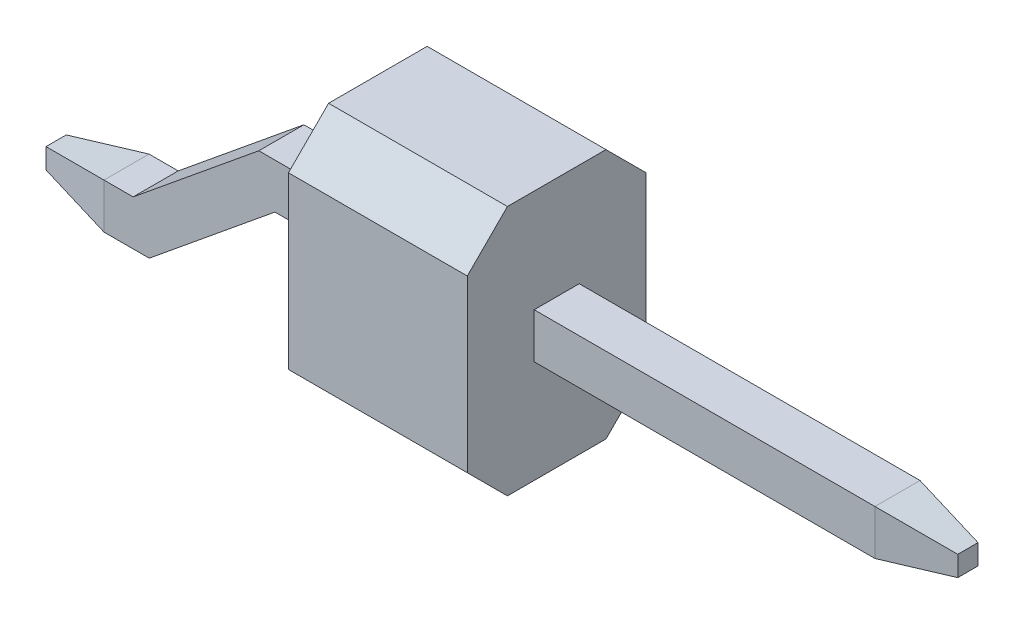
ISO-10303-21;
HEADER;
FILE_DESCRIPTION(('STEP AP214'),'2;1');
FILE_NAME('part.step','',(''),(''),'','','');
FILE_SCHEMA(('AUTOMOTIVE_DESIGN { 1 0 10303 214 1 1 1 1 }'));
ENDSEC;
DATA;
#1=APPLICATION_CONTEXT('core data for automotive mechanical design processes');
#2=APPLICATION_PROTOCOL_DEFINITION('international standard','automotive_design',2000,#1);
#3=PRODUCT_CONTEXT('',#1,'mechanical');
#4=PRODUCT('Part','Part','',(#3));
#5=PRODUCT_RELATED_PRODUCT_CATEGORY('part','',(#4));
#6=PRODUCT_DEFINITION_FORMATION('','',#4);
#7=PRODUCT_DEFINITION_CONTEXT('part definition',#1,'design');
#8=PRODUCT_DEFINITION('design','',#6,#7);
#9=PRODUCT_DEFINITION_SHAPE('','',#8);
#10=(LENGTH_UNIT() NAMED_UNIT(*) SI_UNIT(.MILLI.,.METRE.));
#11=(NAMED_UNIT(*) PLANE_ANGLE_UNIT() SI_UNIT($,.RADIAN.));
#12=(NAMED_UNIT(*) SI_UNIT($,.STERADIAN.) SOLID_ANGLE_UNIT());
#13=UNCERTAINTY_MEASURE_WITH_UNIT(LENGTH_MEASURE(1.E-05),#10,'distance_accuracy_value','');
#14=(GEOMETRIC_REPRESENTATION_CONTEXT(3) GLOBAL_UNCERTAINTY_ASSIGNED_CONTEXT((#13)) GLOBAL_UNIT_ASSIGNED_CONTEXT((#10,
#11,#12)) REPRESENTATION_CONTEXT('',''));
#15=CARTESIAN_POINT('',(0.,0.,0.));
#16=DIRECTION('',(0.,0.,1.));
#17=DIRECTION('',(1.,0.,0.));
#18=AXIS2_PLACEMENT_3D('',#15,#16,#17);
#19=CARTESIAN_POINT('',(0.,3.56,0.));
#20=DIRECTION('',(1.,0.,0.));
#21=DIRECTION('',(0.,0.,-1.));
#22=AXIS2_PLACEMENT_3D('',#19,#20,#21);
#23=PLANE('',#22);
#24=DIRECTION('',(0.,-1.,0.));
#25=VECTOR('',#24,1.);
#26=CARTESIAN_POINT('',(0.,3.56,-2.54));
#27=LINE('',#26,#25);
#28=CARTESIAN_POINT('',(0.,2.99,-2.54));
#29=VERTEX_POINT('',#28);
#30=CARTESIAN_POINT('',(0.,0.569999999999999,-2.54));
#31=VERTEX_POINT('',#30);
#32=EDGE_CURVE('E312',#29,#31,#27,.T.);
#33=ORIENTED_EDGE('',*,*,#32,.T.);
#34=DIRECTION('',(0.,-0.707106781186546,0.707106781186549));
#35=VECTOR('',#34,1.);
#36=CARTESIAN_POINT('',(0.,0.569999999999999,-2.54));
#37=LINE('',#36,#35);
#38=CARTESIAN_POINT('',(0.,0.,-1.97));
#39=VERTEX_POINT('',#38);
#40=EDGE_CURVE('E339',#31,#39,#37,.T.);
#41=ORIENTED_EDGE('',*,*,#40,.T.);
#42=DIRECTION('',(0.,0.,1.));
#43=VECTOR('',#42,1.);
#44=CARTESIAN_POINT('',(0.,0.,0.));
#45=LINE('',#44,#43);
#46=CARTESIAN_POINT('',(0.,0.,-0.570000000000002));
#47=VERTEX_POINT('',#46);
#48=EDGE_CURVE('E304',#39,#47,#45,.T.);
#49=ORIENTED_EDGE('',*,*,#48,.T.);
#50=DIRECTION('',(0.,0.707106781186546,0.707106781186549));
#51=VECTOR('',#50,1.);
#52=CARTESIAN_POINT('',(0.,0.57,0.));
#53=LINE('',#52,#51);
#54=CARTESIAN_POINT('',(0.,0.57,0.));
#55=VERTEX_POINT('',#54);
#56=EDGE_CURVE('E337',#47,#55,#53,.T.);
#57=ORIENTED_EDGE('',*,*,#56,.T.);
#58=DIRECTION('',(0.,-1.,0.));
#59=VECTOR('',#58,1.);
#60=CARTESIAN_POINT('',(0.,3.56,0.));
#61=LINE('',#60,#59);
#62=CARTESIAN_POINT('',(0.,2.99,0.));
#63=VERTEX_POINT('',#62);
#64=EDGE_CURVE('E325',#63,#55,#61,.T.);
#65=ORIENTED_EDGE('',*,*,#64,.F.);
#66=DIRECTION('',(0.,-0.707106781186549,0.707106781186546));
#67=VECTOR('',#66,1.);
#68=CARTESIAN_POINT('',(0.,3.56,-0.569999999999999));
#69=LINE('',#68,#67);
#70=CARTESIAN_POINT('',(0.,3.56,-0.569999999999999));
#71=VERTEX_POINT('',#70);
#72=EDGE_CURVE('E333',#63,#71,#69,.F.);
#73=ORIENTED_EDGE('',*,*,#72,.T.);
#74=DIRECTION('',(0.,0.,1.));
#75=VECTOR('',#74,1.);
#76=CARTESIAN_POINT('',(0.,3.56,0.));
#77=LINE('',#76,#75);
#78=CARTESIAN_POINT('',(0.,3.56,-1.97));
#79=VERTEX_POINT('',#78);
#80=EDGE_CURVE('E305',#79,#71,#77,.T.);
#81=ORIENTED_EDGE('',*,*,#80,.F.);
#82=DIRECTION('',(0.,0.707106781186549,0.707106781186546));
#83=VECTOR('',#82,1.);
#84=CARTESIAN_POINT('',(0.,3.56,-1.97));
#85=LINE('',#84,#83);
#86=EDGE_CURVE('E335',#79,#29,#85,.F.);
#87=ORIENTED_EDGE('',*,*,#86,.T.);
#88=EDGE_LOOP('',(#33,#41,#49,#57,#65,#73,#81,#87));
#89=FACE_BOUND('',#88,.T.);
#90=DIRECTION('',(0.,0.,-1.));
#91=VECTOR('',#90,1.);
#92=CARTESIAN_POINT('',(0.,2.1,-1.59));
#93=LINE('',#92,#91);
#94=CARTESIAN_POINT('',(0.,2.1,-0.95));
#95=VERTEX_POINT('',#94);
#96=CARTESIAN_POINT('',(0.,2.1,-1.59));
#97=VERTEX_POINT('',#96);
#98=EDGE_CURVE('E205',#95,#97,#93,.T.);
#99=ORIENTED_EDGE('',*,*,#98,.F.);
#100=DIRECTION('',(0.,1.,0.));
#101=VECTOR('',#100,1.);
#102=CARTESIAN_POINT('',(0.,2.1,-0.95));
#103=LINE('',#102,#101);
#104=CARTESIAN_POINT('',(0.,1.46,-0.95));
#105=VERTEX_POINT('',#104);
#106=EDGE_CURVE('E273',#105,#95,#103,.T.);
#107=ORIENTED_EDGE('',*,*,#106,.F.);
#108=DIRECTION('',(0.,0.,1.));
#109=VECTOR('',#108,1.);
#110=CARTESIAN_POINT('',(0.,1.46,-0.95));
#111=LINE('',#110,#109);
#112=CARTESIAN_POINT('',(0.,1.46,-1.59));
#113=VERTEX_POINT('',#112);
#114=EDGE_CURVE('E270',#113,#105,#111,.T.);
#115=ORIENTED_EDGE('',*,*,#114,.F.);
#116=DIRECTION('',(0.,-1.,0.));
#117=VECTOR('',#116,1.);
#118=CARTESIAN_POINT('',(0.,1.46,-1.59));
#119=LINE('',#118,#117);
#120=EDGE_CURVE('E268',#97,#113,#119,.T.);
#121=ORIENTED_EDGE('',*,*,#120,.F.);
#122=EDGE_LOOP('',(#99,#107,#115,#121));
#123=FACE_BOUND('',#122,.T.);
#124=ADVANCED_FACE('F36',(#89,#123),#23,.F.);
#125=CARTESIAN_POINT('',(2.54,3.56,0.));
#126=DIRECTION('',(-1.,0.,0.));
#127=DIRECTION('',(0.,0.,1.));
#128=AXIS2_PLACEMENT_3D('',#125,#126,#127);
#129=PLANE('',#128);
#130=DIRECTION('',(0.,0.,-1.));
#131=VECTOR('',#130,1.);
#132=CARTESIAN_POINT('',(2.54,0.,0.));
#133=LINE('',#132,#131);
#134=CARTESIAN_POINT('',(2.54,0.,-0.570000000000002));
#135=VERTEX_POINT('',#134);
#136=CARTESIAN_POINT('',(2.54,0.,-1.97));
#137=VERTEX_POINT('',#136);
#138=EDGE_CURVE('E309',#135,#137,#133,.T.);
#139=ORIENTED_EDGE('',*,*,#138,.T.);
#140=DIRECTION('',(0.,0.707106781186546,-0.707106781186549));
#141=VECTOR('',#140,1.);
#142=CARTESIAN_POINT('',(2.54,0.569999999999999,-2.54));
#143=LINE('',#142,#141);
#144=CARTESIAN_POINT('',(2.54,0.569999999999999,-2.54));
#145=VERTEX_POINT('',#144);
#146=EDGE_CURVE('E351',#137,#145,#143,.T.);
#147=ORIENTED_EDGE('',*,*,#146,.T.);
#148=DIRECTION('',(0.,-1.,0.));
#149=VECTOR('',#148,1.);
#150=CARTESIAN_POINT('',(2.54,3.56,-2.54));
#151=LINE('',#150,#149);
#152=CARTESIAN_POINT('',(2.54,2.99,-2.54));
#153=VERTEX_POINT('',#152);
#154=EDGE_CURVE('E319',#153,#145,#151,.T.);
#155=ORIENTED_EDGE('',*,*,#154,.F.);
#156=DIRECTION('',(0.,-0.707106781186549,-0.707106781186546));
#157=VECTOR('',#156,1.);
#158=CARTESIAN_POINT('',(2.54,3.56,-1.97));
#159=LINE('',#158,#157);
#160=CARTESIAN_POINT('',(2.54,3.56,-1.97));
#161=VERTEX_POINT('',#160);
#162=EDGE_CURVE('E347',#153,#161,#159,.F.);
#163=ORIENTED_EDGE('',*,*,#162,.T.);
#164=DIRECTION('',(0.,0.,-1.));
#165=VECTOR('',#164,1.);
#166=CARTESIAN_POINT('',(2.54,3.56,0.));
#167=LINE('',#166,#165);
#168=CARTESIAN_POINT('',(2.54,3.56,-0.569999999999999));
#169=VERTEX_POINT('',#168);
#170=EDGE_CURVE('E308',#169,#161,#167,.T.);
#171=ORIENTED_EDGE('',*,*,#170,.F.);
#172=DIRECTION('',(0.,0.707106781186549,-0.707106781186546));
#173=VECTOR('',#172,1.);
#174=CARTESIAN_POINT('',(2.54,3.56,-0.569999999999999));
#175=LINE('',#174,#173);
#176=CARTESIAN_POINT('',(2.54,2.99,0.));
#177=VERTEX_POINT('',#176);
#178=EDGE_CURVE('E345',#169,#177,#175,.F.);
#179=ORIENTED_EDGE('',*,*,#178,.T.);
#180=DIRECTION('',(0.,-1.,0.));
#181=VECTOR('',#180,1.);
#182=CARTESIAN_POINT('',(2.54,3.56,0.));
#183=LINE('',#182,#181);
#184=CARTESIAN_POINT('',(2.54,0.57,0.));
#185=VERTEX_POINT('',#184);
#186=EDGE_CURVE('E322',#177,#185,#183,.T.);
#187=ORIENTED_EDGE('',*,*,#186,.T.);
#188=DIRECTION('',(0.,-0.707106781186546,-0.707106781186549));
#189=VECTOR('',#188,1.);
#190=CARTESIAN_POINT('',(2.54,0.57,0.));
#191=LINE('',#190,#189);
#192=EDGE_CURVE('E349',#185,#135,#191,.T.);
#193=ORIENTED_EDGE('',*,*,#192,.T.);
#194=EDGE_LOOP('',(#139,#147,#155,#163,#171,#179,#187,#193));
#195=FACE_BOUND('',#194,.T.);
#196=DIRECTION('',(0.,-1.,0.));
#197=VECTOR('',#196,1.);
#198=CARTESIAN_POINT('',(2.54,2.1,-0.95));
#199=LINE('',#198,#197);
#200=CARTESIAN_POINT('',(2.54,2.1,-0.95));
#201=VERTEX_POINT('',#200);
#202=CARTESIAN_POINT('',(2.54,1.46,-0.95));
#203=VERTEX_POINT('',#202);
#204=EDGE_CURVE('E284',#201,#203,#199,.T.);
#205=ORIENTED_EDGE('',*,*,#204,.F.);
#206=DIRECTION('',(0.,0.,1.));
#207=VECTOR('',#206,1.);
#208=CARTESIAN_POINT('',(2.54,2.1,-0.95));
#209=LINE('',#208,#207);
#210=CARTESIAN_POINT('',(2.54,2.1,-1.59));
#211=VERTEX_POINT('',#210);
#212=EDGE_CURVE('E293',#211,#201,#209,.T.);
#213=ORIENTED_EDGE('',*,*,#212,.F.);
#214=DIRECTION('',(0.,1.,0.));
#215=VECTOR('',#214,1.);
#216=CARTESIAN_POINT('',(2.54,2.1,-1.59));
#217=LINE('',#216,#215);
#218=CARTESIAN_POINT('',(2.54,1.46,-1.59));
#219=VERTEX_POINT('',#218);
#220=EDGE_CURVE('E290',#219,#211,#217,.T.);
#221=ORIENTED_EDGE('',*,*,#220,.F.);
#222=DIRECTION('',(0.,0.,-1.));
#223=VECTOR('',#222,1.);
#224=CARTESIAN_POINT('',(2.54,1.46,-0.95));
#225=LINE('',#224,#223);
#226=EDGE_CURVE('E287',#203,#219,#225,.T.);
#227=ORIENTED_EDGE('',*,*,#226,.F.);
#228=EDGE_LOOP('',(#205,#213,#221,#227));
#229=FACE_BOUND('',#228,.T.);
#230=ADVANCED_FACE('F408',(#195,#229),#129,.F.);
#231=CARTESIAN_POINT('',(0.,3.56,0.));
#232=DIRECTION('',(0.,0.,-1.));
#233=DIRECTION('',(-1.,0.,0.));
#234=AXIS2_PLACEMENT_3D('',#231,#232,#233);
#235=PLANE('',#234);
#236=ORIENTED_EDGE('',*,*,#64,.T.);
#237=DIRECTION('',(1.,0.,0.));
#238=VECTOR('',#237,1.);
#239=CARTESIAN_POINT('',(2.54,0.57,0.));
#240=LINE('',#239,#238);
#241=EDGE_CURVE('E355',#55,#185,#240,.T.);
#242=ORIENTED_EDGE('',*,*,#241,.T.);
#243=ORIENTED_EDGE('',*,*,#186,.F.);
#244=DIRECTION('',(-1.,0.,0.));
#245=VECTOR('',#244,1.);
#246=CARTESIAN_POINT('',(0.,2.99,0.));
#247=LINE('',#246,#245);
#248=EDGE_CURVE('E353',#177,#63,#247,.T.);
#249=ORIENTED_EDGE('',*,*,#248,.T.);
#250=EDGE_LOOP('',(#236,#242,#243,#249));
#251=FACE_BOUND('',#250,.T.);
#252=ADVANCED_FACE('F431',(#251),#235,.F.);
#253=CARTESIAN_POINT('',(0.,3.56,-2.54));
#254=DIRECTION('',(0.,0.,1.));
#255=DIRECTION('',(1.,0.,0.));
#256=AXIS2_PLACEMENT_3D('',#253,#254,#255);
#257=PLANE('',#256);
#258=ORIENTED_EDGE('',*,*,#154,.T.);
#259=DIRECTION('',(-1.,0.,0.));
#260=VECTOR('',#259,1.);
#261=CARTESIAN_POINT('',(0.,0.569999999999999,-2.54));
#262=LINE('',#261,#260);
#263=EDGE_CURVE('E330',#145,#31,#262,.T.);
#264=ORIENTED_EDGE('',*,*,#263,.T.);
#265=ORIENTED_EDGE('',*,*,#32,.F.);
#266=DIRECTION('',(1.,0.,0.));
#267=VECTOR('',#266,1.);
#268=CARTESIAN_POINT('',(0.,2.99,-2.54));
#269=LINE('',#268,#267);
#270=EDGE_CURVE('E328',#29,#153,#269,.T.);
#271=ORIENTED_EDGE('',*,*,#270,.T.);
#272=EDGE_LOOP('',(#258,#264,#265,#271));
#273=FACE_BOUND('',#272,.T.);
#274=ADVANCED_FACE('F553',(#273),#257,.F.);
#275=CARTESIAN_POINT('',(0.,3.56,0.));
#276=DIRECTION('',(0.,-1.,0.));
#277=DIRECTION('',(0.,0.,-1.));
#278=AXIS2_PLACEMENT_3D('',#275,#276,#277);
#279=PLANE('',#278);
#280=ORIENTED_EDGE('',*,*,#170,.T.);
#281=DIRECTION('',(-1.,0.,0.));
#282=VECTOR('',#281,1.);
#283=CARTESIAN_POINT('',(0.,3.56,-1.97));
#284=LINE('',#283,#282);
#285=EDGE_CURVE('E361',#161,#79,#284,.T.);
#286=ORIENTED_EDGE('',*,*,#285,.T.);
#287=ORIENTED_EDGE('',*,*,#80,.T.);
#288=DIRECTION('',(1.,0.,0.));
#289=VECTOR('',#288,1.);
#290=CARTESIAN_POINT('',(0.,3.56,-0.569999999999999));
#291=LINE('',#290,#289);
#292=EDGE_CURVE('E358',#71,#169,#291,.T.);
#293=ORIENTED_EDGE('',*,*,#292,.T.);
#294=EDGE_LOOP('',(#280,#286,#287,#293));
#295=FACE_BOUND('',#294,.T.);
#296=ADVANCED_FACE('F543',(#295),#279,.F.);
#297=CARTESIAN_POINT('',(0.,0.,0.));
#298=DIRECTION('',(0.,-1.,0.));
#299=DIRECTION('',(0.,0.,-1.));
#300=AXIS2_PLACEMENT_3D('',#297,#298,#299);
#301=PLANE('',#300);
#302=ORIENTED_EDGE('',*,*,#48,.F.);
#303=DIRECTION('',(1.,0.,0.));
#304=VECTOR('',#303,1.);
#305=CARTESIAN_POINT('',(2.54,0.,-1.97));
#306=LINE('',#305,#304);
#307=EDGE_CURVE('E343',#39,#137,#306,.T.);
#308=ORIENTED_EDGE('',*,*,#307,.T.);
#309=ORIENTED_EDGE('',*,*,#138,.F.);
#310=DIRECTION('',(-1.,0.,0.));
#311=VECTOR('',#310,1.);
#312=CARTESIAN_POINT('',(0.,0.,-0.570000000000002));
#313=LINE('',#312,#311);
#314=EDGE_CURVE('E341',#135,#47,#313,.T.);
#315=ORIENTED_EDGE('',*,*,#314,.T.);
#316=EDGE_LOOP('',(#302,#308,#309,#315));
#317=FACE_BOUND('',#316,.T.);
#318=ADVANCED_FACE('F516',(#317),#301,.T.);
#319=CARTESIAN_POINT('',(8.38,2.1,-0.95));
#320=DIRECTION('',(0.,0.,-1.));
#321=DIRECTION('',(0.,1.,0.));
#322=AXIS2_PLACEMENT_3D('',#319,#320,#321);
#323=PLANE('',#322);
#324=DIRECTION('',(-1.,0.,0.));
#325=VECTOR('',#324,1.);
#326=CARTESIAN_POINT('',(8.38,1.46,-0.95));
#327=LINE('',#326,#325);
#328=CARTESIAN_POINT('',(7.37999999999998,1.46,-0.95));
#329=VERTEX_POINT('',#328);
#330=EDGE_CURVE('E302',#329,#203,#327,.T.);
#331=ORIENTED_EDGE('',*,*,#330,.F.);
#332=DIRECTION('',(0.,1.,0.));
#333=VECTOR('',#332,1.);
#334=CARTESIAN_POINT('',(7.37999999999998,2.1,-0.95));
#335=LINE('',#334,#333);
#336=CARTESIAN_POINT('',(7.37999999999998,2.1,-0.95));
#337=VERTEX_POINT('',#336);
#338=EDGE_CURVE('E11',#329,#337,#335,.T.);
#339=ORIENTED_EDGE('',*,*,#338,.T.);
#340=DIRECTION('',(-1.,0.,0.));
#341=VECTOR('',#340,1.);
#342=CARTESIAN_POINT('',(8.38,2.1,-0.95));
#343=LINE('',#342,#341);
#344=EDGE_CURVE('E296',#337,#201,#343,.T.);
#345=ORIENTED_EDGE('',*,*,#344,.T.);
#346=ORIENTED_EDGE('',*,*,#204,.T.);
#347=EDGE_LOOP('',(#331,#339,#345,#346));
#348=FACE_BOUND('',#347,.T.);
#349=ADVANCED_FACE('F403',(#348),#323,.F.);
#350=CARTESIAN_POINT('',(8.38,1.46,-0.95));
#351=DIRECTION('',(0.,1.,0.));
#352=DIRECTION('',(0.,0.,1.));
#353=AXIS2_PLACEMENT_3D('',#350,#351,#352);
#354=PLANE('',#353);
#355=DIRECTION('',(-1.,0.,0.));
#356=VECTOR('',#355,1.);
#357=CARTESIAN_POINT('',(8.38,1.46,-1.59));
#358=LINE('',#357,#356);
#359=CARTESIAN_POINT('',(7.37999999999998,1.46,-1.59));
#360=VERTEX_POINT('',#359);
#361=EDGE_CURVE('E300',#360,#219,#358,.T.);
#362=ORIENTED_EDGE('',*,*,#361,.F.);
#363=DIRECTION('',(0.,0.,1.));
#364=VECTOR('',#363,1.);
#365=CARTESIAN_POINT('',(7.37999999999998,1.46,-0.95));
#366=LINE('',#365,#364);
#367=EDGE_CURVE('E45',#360,#329,#366,.T.);
#368=ORIENTED_EDGE('',*,*,#367,.T.);
#369=ORIENTED_EDGE('',*,*,#330,.T.);
#370=ORIENTED_EDGE('',*,*,#226,.T.);
#371=EDGE_LOOP('',(#362,#368,#369,#370));
#372=FACE_BOUND('',#371,.T.);
#373=ADVANCED_FACE('F400',(#372),#354,.F.);
#374=CARTESIAN_POINT('',(8.38,2.1,-1.59));
#375=DIRECTION('',(0.,0.,1.));
#376=DIRECTION('',(1.,0.,0.));
#377=AXIS2_PLACEMENT_3D('',#374,#375,#376);
#378=PLANE('',#377);
#379=DIRECTION('',(-1.,0.,0.));
#380=VECTOR('',#379,1.);
#381=CARTESIAN_POINT('',(8.38,2.1,-1.59));
#382=LINE('',#381,#380);
#383=CARTESIAN_POINT('',(7.37999999999998,2.1,-1.59));
#384=VERTEX_POINT('',#383);
#385=EDGE_CURVE('E298',#384,#211,#382,.T.);
#386=ORIENTED_EDGE('',*,*,#385,.F.);
#387=DIRECTION('',(0.,-1.,0.));
#388=VECTOR('',#387,1.);
#389=CARTESIAN_POINT('',(7.37999999999998,1.46,-1.59));
#390=LINE('',#389,#388);
#391=EDGE_CURVE('E376',#384,#360,#390,.T.);
#392=ORIENTED_EDGE('',*,*,#391,.T.);
#393=ORIENTED_EDGE('',*,*,#361,.T.);
#394=ORIENTED_EDGE('',*,*,#220,.T.);
#395=EDGE_LOOP('',(#386,#392,#393,#394));
#396=FACE_BOUND('',#395,.T.);
#397=ADVANCED_FACE('F415',(#396),#378,.F.);
#398=CARTESIAN_POINT('',(8.38,2.1,-0.95));
#399=DIRECTION('',(0.,-1.,0.));
#400=DIRECTION('',(0.,0.,-1.));
#401=AXIS2_PLACEMENT_3D('',#398,#399,#400);
#402=PLANE('',#401);
#403=ORIENTED_EDGE('',*,*,#344,.F.);
#404=DIRECTION('',(0.,0.,-1.));
#405=VECTOR('',#404,1.);
#406=CARTESIAN_POINT('',(7.37999999999998,2.1,-1.59));
#407=LINE('',#406,#405);
#408=EDGE_CURVE('E373',#337,#384,#407,.T.);
#409=ORIENTED_EDGE('',*,*,#408,.T.);
#410=ORIENTED_EDGE('',*,*,#385,.T.);
#411=ORIENTED_EDGE('',*,*,#212,.T.);
#412=EDGE_LOOP('',(#403,#409,#410,#411));
#413=FACE_BOUND('',#412,.T.);
#414=ADVANCED_FACE('F411',(#413),#402,.F.);
#415=CARTESIAN_POINT('',(8.38,0.,0.));
#416=DIRECTION('',(1.,0.,0.));
#417=DIRECTION('',(0.,0.,-1.));
#418=AXIS2_PLACEMENT_3D('',#415,#416,#417);
#419=PLANE('',#418);
#420=DIRECTION('',(0.,1.,0.));
#421=VECTOR('',#420,1.);
#422=CARTESIAN_POINT('',(8.38,2.1,-1.41367301929153));
#423=LINE('',#422,#421);
#424=CARTESIAN_POINT('',(8.38,1.63632698070847,-1.41367301929153));
#425=VERTEX_POINT('',#424);
#426=CARTESIAN_POINT('',(8.38,1.92367301929153,-1.41367301929153));
#427=VERTEX_POINT('',#426);
#428=EDGE_CURVE('E368',#425,#427,#423,.T.);
#429=ORIENTED_EDGE('',*,*,#428,.T.);
#430=DIRECTION('',(0.,0.,1.));
#431=VECTOR('',#430,1.);
#432=CARTESIAN_POINT('',(8.38,1.92367301929153,-0.95));
#433=LINE('',#432,#431);
#434=CARTESIAN_POINT('',(8.38,1.92367301929153,-1.12632698070847));
#435=VERTEX_POINT('',#434);
#436=EDGE_CURVE('E370',#427,#435,#433,.T.);
#437=ORIENTED_EDGE('',*,*,#436,.T.);
#438=DIRECTION('',(0.,-1.,0.));
#439=VECTOR('',#438,1.);
#440=CARTESIAN_POINT('',(8.38,1.46,-1.12632698070847));
#441=LINE('',#440,#439);
#442=CARTESIAN_POINT('',(8.38,1.63632698070847,-1.12632698070847));
#443=VERTEX_POINT('',#442);
#444=EDGE_CURVE('E364',#435,#443,#441,.T.);
#445=ORIENTED_EDGE('',*,*,#444,.T.);
#446=DIRECTION('',(0.,0.,-1.));
#447=VECTOR('',#446,1.);
#448=CARTESIAN_POINT('',(8.38,1.63632698070847,-1.59));
#449=LINE('',#448,#447);
#450=EDGE_CURVE('E366',#443,#425,#449,.T.);
#451=ORIENTED_EDGE('',*,*,#450,.T.);
#452=EDGE_LOOP('',(#429,#437,#445,#451));
#453=FACE_BOUND('',#452,.T.);
#454=ADVANCED_FACE('F422',(#453),#419,.T.);
#455=CARTESIAN_POINT('',(0.,0.569999999999999,-2.54));
#456=DIRECTION('',(0.,-0.707106781186549,-0.707106781186546));
#457=DIRECTION('',(1.,0.,0.));
#458=AXIS2_PLACEMENT_3D('',#455,#456,#457);
#459=PLANE('',#458);
#460=ORIENTED_EDGE('',*,*,#146,.F.);
#461=ORIENTED_EDGE('',*,*,#307,.F.);
#462=ORIENTED_EDGE('',*,*,#40,.F.);
#463=ORIENTED_EDGE('',*,*,#263,.F.);
#464=EDGE_LOOP('',(#460,#461,#462,#463));
#465=FACE_BOUND('',#464,.T.);
#466=ADVANCED_FACE('F437',(#465),#459,.T.);
#467=CARTESIAN_POINT('',(0.,0.57,0.));
#468=DIRECTION('',(0.,-0.707106781186549,0.707106781186546));
#469=DIRECTION('',(-1.,0.,0.));
#470=AXIS2_PLACEMENT_3D('',#467,#468,#469);
#471=PLANE('',#470);
#472=ORIENTED_EDGE('',*,*,#56,.F.);
#473=ORIENTED_EDGE('',*,*,#314,.F.);
#474=ORIENTED_EDGE('',*,*,#192,.F.);
#475=ORIENTED_EDGE('',*,*,#241,.F.);
#476=EDGE_LOOP('',(#472,#473,#474,#475));
#477=FACE_BOUND('',#476,.T.);
#478=ADVANCED_FACE('F440',(#477),#471,.T.);
#479=CARTESIAN_POINT('',(0.,3.56,-1.97));
#480=DIRECTION('',(0.,-0.707106781186546,0.707106781186549));
#481=DIRECTION('',(-1.,0.,0.));
#482=AXIS2_PLACEMENT_3D('',#479,#480,#481);
#483=PLANE('',#482);
#484=ORIENTED_EDGE('',*,*,#162,.F.);
#485=ORIENTED_EDGE('',*,*,#270,.F.);
#486=ORIENTED_EDGE('',*,*,#86,.F.);
#487=ORIENTED_EDGE('',*,*,#285,.F.);
#488=EDGE_LOOP('',(#484,#485,#486,#487));
#489=FACE_BOUND('',#488,.T.);
#490=ADVANCED_FACE('F444',(#489),#483,.F.);
#491=CARTESIAN_POINT('',(0.,3.56,-0.569999999999999));
#492=DIRECTION('',(0.,-0.707106781186546,-0.707106781186549));
#493=DIRECTION('',(1.,0.,0.));
#494=AXIS2_PLACEMENT_3D('',#491,#492,#493);
#495=PLANE('',#494);
#496=ORIENTED_EDGE('',*,*,#72,.F.);
#497=ORIENTED_EDGE('',*,*,#248,.F.);
#498=ORIENTED_EDGE('',*,*,#178,.F.);
#499=ORIENTED_EDGE('',*,*,#292,.F.);
#500=EDGE_LOOP('',(#496,#497,#498,#499));
#501=FACE_BOUND('',#500,.T.);
#502=ADVANCED_FACE('F448',(#501),#495,.F.);
#503=CARTESIAN_POINT('',(8.38,1.63632698070847,0.));
#504=DIRECTION('',(0.173648177666928,-0.984807753012209,0.));
#505=DIRECTION('',(0.,0.,1.));
#506=AXIS2_PLACEMENT_3D('',#503,#504,#505);
#507=PLANE('',#506);
#508=DIRECTION('',(0.970287525247815,0.171087869746033,-0.171087869746033));
#509=VECTOR('',#508,1.);
#510=CARTESIAN_POINT('',(8.1083624792515,1.58842995682775,-1.07842995682775));
#511=LINE('',#510,#509);
#512=EDGE_CURVE('E381',#329,#443,#511,.T.);
#513=ORIENTED_EDGE('',*,*,#512,.F.);
#514=ORIENTED_EDGE('',*,*,#367,.F.);
#515=DIRECTION('',(0.970287525247815,0.171087869746033,0.171087869746033));
#516=VECTOR('',#515,1.);
#517=CARTESIAN_POINT('',(8.61467597774569,1.67770668730917,-1.37229331269083));
#518=LINE('',#517,#516);
#519=EDGE_CURVE('E40',#425,#360,#518,.F.);
#520=ORIENTED_EDGE('',*,*,#519,.F.);
#521=ORIENTED_EDGE('',*,*,#450,.F.);
#522=EDGE_LOOP('',(#513,#514,#520,#521));
#523=FACE_BOUND('',#522,.T.);
#524=ADVANCED_FACE('F38',(#523),#507,.T.);
#525=CARTESIAN_POINT('',(8.38,0.,-1.41367301929153));
#526=DIRECTION('',(0.173648177666928,0.,-0.984807753012209));
#527=DIRECTION('',(0.,-1.,0.));
#528=AXIS2_PLACEMENT_3D('',#525,#526,#527);
#529=PLANE('',#528);
#530=ORIENTED_EDGE('',*,*,#519,.T.);
#531=ORIENTED_EDGE('',*,*,#391,.F.);
#532=DIRECTION('',(0.970287525247815,-0.171087869746033,0.171087869746033));
#533=VECTOR('',#532,1.);
#534=CARTESIAN_POINT('',(8.69933823487094,1.86736507251197,-1.35736507251197));
#535=LINE('',#534,#533);
#536=EDGE_CURVE('E380',#427,#384,#535,.F.);
#537=ORIENTED_EDGE('',*,*,#536,.F.);
#538=ORIENTED_EDGE('',*,*,#428,.F.);
#539=EDGE_LOOP('',(#530,#531,#537,#538));
#540=FACE_BOUND('',#539,.T.);
#541=ADVANCED_FACE('F392',(#540),#529,.T.);
#542=CARTESIAN_POINT('',(8.38,0.,-1.12632698070847));
#543=DIRECTION('',(0.173648177666928,0.,0.984807753012209));
#544=DIRECTION('',(0.,1.,0.));
#545=AXIS2_PLACEMENT_3D('',#542,#543,#544);
#546=PLANE('',#545);
#547=ORIENTED_EDGE('',*,*,#512,.T.);
#548=ORIENTED_EDGE('',*,*,#444,.F.);
#549=DIRECTION('',(-0.970287525247815,0.171087869746033,0.171087869746033));
#550=VECTOR('',#549,1.);
#551=CARTESIAN_POINT('',(8.69933823487094,1.86736507251197,-1.18263492748803));
#552=LINE('',#551,#550);
#553=EDGE_CURVE('E283',#337,#435,#552,.F.);
#554=ORIENTED_EDGE('',*,*,#553,.F.);
#555=ORIENTED_EDGE('',*,*,#338,.F.);
#556=EDGE_LOOP('',(#547,#548,#554,#555));
#557=FACE_BOUND('',#556,.T.);
#558=ADVANCED_FACE('F457',(#557),#546,.T.);
#559=CARTESIAN_POINT('',(8.38,1.92367301929153,0.));
#560=DIRECTION('',(0.173648177666928,0.984807753012209,0.));
#561=DIRECTION('',(0.,0.,-1.));
#562=AXIS2_PLACEMENT_3D('',#559,#560,#561);
#563=PLANE('',#562);
#564=ORIENTED_EDGE('',*,*,#536,.T.);
#565=ORIENTED_EDGE('',*,*,#408,.F.);
#566=ORIENTED_EDGE('',*,*,#553,.T.);
#567=ORIENTED_EDGE('',*,*,#436,.F.);
#568=EDGE_LOOP('',(#564,#565,#566,#567));
#569=FACE_BOUND('',#568,.T.);
#570=ADVANCED_FACE('F453',(#569),#563,.T.);
#571=CARTESIAN_POINT('',(-2.285,2.1,-1.59));
#572=DIRECTION('',(0.,-1.,0.));
#573=DIRECTION('',(0.,0.,-1.));
#574=AXIS2_PLACEMENT_3D('',#571,#572,#573);
#575=PLANE('',#574);
#576=DIRECTION('',(1.,0.,0.));
#577=VECTOR('',#576,1.);
#578=CARTESIAN_POINT('',(-2.285,2.1,-1.59));
#579=LINE('',#578,#577);
#580=CARTESIAN_POINT('',(-1.37090152534265,2.1,-1.59));
#581=VERTEX_POINT('',#580);
#582=EDGE_CURVE('E61',#581,#97,#579,.T.);
#583=ORIENTED_EDGE('',*,*,#582,.F.);
#584=DIRECTION('',(0.,0.,-1.));
#585=VECTOR('',#584,1.);
#586=CARTESIAN_POINT('',(-1.37090152534265,2.1,0.));
#587=LINE('',#586,#585);
#588=CARTESIAN_POINT('',(-1.37090152534265,2.1,-0.95));
#589=VERTEX_POINT('',#588);
#590=EDGE_CURVE('E216',#589,#581,#587,.T.);
#591=ORIENTED_EDGE('',*,*,#590,.F.);
#592=DIRECTION('',(1.,0.,0.));
#593=VECTOR('',#592,1.);
#594=CARTESIAN_POINT('',(-2.285,2.1,-0.95));
#595=LINE('',#594,#593);
#596=EDGE_CURVE('E276',#589,#95,#595,.T.);
#597=ORIENTED_EDGE('',*,*,#596,.T.);
#598=ORIENTED_EDGE('',*,*,#98,.T.);
#599=EDGE_LOOP('',(#583,#591,#597,#598));
#600=FACE_BOUND('',#599,.T.);
#601=ADVANCED_FACE('F456',(#600),#575,.F.);
#602=CARTESIAN_POINT('',(-2.285,1.46,-1.59));
#603=DIRECTION('',(0.,0.,1.));
#604=DIRECTION('',(1.,0.,0.));
#605=AXIS2_PLACEMENT_3D('',#602,#603,#604);
#606=PLANE('',#605);
#607=DIRECTION('',(-0.77405389397788,-0.633119711600959,0.));
#608=VECTOR('',#607,1.);
#609=CARTESIAN_POINT('',(-2.285,0.525518207282909,-1.59));
#610=LINE('',#609,#608);
#611=CARTESIAN_POINT('',(-1.1425,1.46,-1.59));
#612=VERTEX_POINT('',#611);
#613=CARTESIAN_POINT('',(-2.92749999999999,0.,-1.59));
#614=VERTEX_POINT('',#613);
#615=EDGE_CURVE('E251',#612,#614,#610,.T.);
#616=ORIENTED_EDGE('',*,*,#615,.T.);
#617=DIRECTION('',(1.,0.,0.));
#618=VECTOR('',#617,1.);
#619=CARTESIAN_POINT('',(-4.57,0.,-1.59));
#620=LINE('',#619,#618);
#621=CARTESIAN_POINT('',(-3.56999999999998,0.,-1.59));
#622=VERTEX_POINT('',#621);
#623=EDGE_CURVE('E215',#622,#614,#620,.T.);
#624=ORIENTED_EDGE('',*,*,#623,.F.);
#625=DIRECTION('',(0.,1.,0.));
#626=VECTOR('',#625,1.);
#627=CARTESIAN_POINT('',(-3.56999999999998,0.639999999999999,-1.59));
#628=LINE('',#627,#626);
#629=CARTESIAN_POINT('',(-3.56999999999998,0.639999999999999,-1.59));
#630=VERTEX_POINT('',#629);
#631=EDGE_CURVE('E246',#622,#630,#628,.T.);
#632=ORIENTED_EDGE('',*,*,#631,.T.);
#633=DIRECTION('',(1.,0.,0.));
#634=VECTOR('',#633,1.);
#635=CARTESIAN_POINT('',(-4.57,0.639999999999999,-1.59));
#636=LINE('',#635,#634);
#637=CARTESIAN_POINT('',(-3.15590152534264,0.639999999999999,-1.59));
#638=VERTEX_POINT('',#637);
#639=EDGE_CURVE('E224',#630,#638,#636,.T.);
#640=ORIENTED_EDGE('',*,*,#639,.T.);
#641=DIRECTION('',(0.77405389397788,0.633119711600959,0.));
#642=VECTOR('',#641,1.);
#643=CARTESIAN_POINT('',(-3.15590152534264,0.639999999999999,-1.59));
#644=LINE('',#643,#642);
#645=EDGE_CURVE('E262',#638,#581,#644,.T.);
#646=ORIENTED_EDGE('',*,*,#645,.T.);
#647=ORIENTED_EDGE('',*,*,#582,.T.);
#648=ORIENTED_EDGE('',*,*,#120,.T.);
#649=DIRECTION('',(1.,0.,0.));
#650=VECTOR('',#649,1.);
#651=CARTESIAN_POINT('',(-2.285,1.46,-1.59));
#652=LINE('',#651,#650);
#653=EDGE_CURVE('E280',#612,#113,#652,.T.);
#654=ORIENTED_EDGE('',*,*,#653,.F.);
#655=EDGE_LOOP('',(#616,#624,#632,#640,#646,#647,#648,#654));
#656=FACE_BOUND('',#655,.T.);
#657=ADVANCED_FACE('F602',(#656),#606,.F.);
#658=CARTESIAN_POINT('',(-2.285,1.46,-0.95));
#659=DIRECTION('',(0.,1.,0.));
#660=DIRECTION('',(0.,0.,1.));
#661=AXIS2_PLACEMENT_3D('',#658,#659,#660);
#662=PLANE('',#661);
#663=DIRECTION('',(1.,0.,0.));
#664=VECTOR('',#663,1.);
#665=CARTESIAN_POINT('',(-2.285,1.46,-0.95));
#666=LINE('',#665,#664);
#667=CARTESIAN_POINT('',(-1.1425,1.46,-0.95));
#668=VERTEX_POINT('',#667);
#669=EDGE_CURVE('E278',#668,#105,#666,.T.);
#670=ORIENTED_EDGE('',*,*,#669,.F.);
#671=DIRECTION('',(0.,0.,-1.));
#672=VECTOR('',#671,1.);
#673=CARTESIAN_POINT('',(-1.1425,1.46,1.26969410576589));
#674=LINE('',#673,#672);
#675=EDGE_CURVE('E53',#668,#612,#674,.T.);
#676=ORIENTED_EDGE('',*,*,#675,.T.);
#677=ORIENTED_EDGE('',*,*,#653,.T.);
#678=ORIENTED_EDGE('',*,*,#114,.T.);
#679=EDGE_LOOP('',(#670,#676,#677,#678));
#680=FACE_BOUND('',#679,.T.);
#681=ADVANCED_FACE('F597',(#680),#662,.F.);
#682=CARTESIAN_POINT('',(-2.285,2.1,-0.95));
#683=DIRECTION('',(0.,0.,-1.));
#684=DIRECTION('',(0.,1.,0.));
#685=AXIS2_PLACEMENT_3D('',#682,#683,#684);
#686=PLANE('',#685);
#687=DIRECTION('',(1.,0.,0.));
#688=VECTOR('',#687,1.);
#689=CARTESIAN_POINT('',(-4.57,0.,-0.95));
#690=LINE('',#689,#688);
#691=CARTESIAN_POINT('',(-3.56999999999998,0.,-0.95));
#692=VERTEX_POINT('',#691);
#693=CARTESIAN_POINT('',(-2.92749999999999,0.,-0.95));
#694=VERTEX_POINT('',#693);
#695=EDGE_CURVE('E212',#692,#694,#690,.T.);
#696=ORIENTED_EDGE('',*,*,#695,.T.);
#697=DIRECTION('',(0.77405389397788,0.633119711600959,0.));
#698=VECTOR('',#697,1.);
#699=CARTESIAN_POINT('',(-2.285,0.525518207282909,-0.95));
#700=LINE('',#699,#698);
#701=EDGE_CURVE('E197',#694,#668,#700,.T.);
#702=ORIENTED_EDGE('',*,*,#701,.T.);
#703=ORIENTED_EDGE('',*,*,#669,.T.);
#704=ORIENTED_EDGE('',*,*,#106,.T.);
#705=ORIENTED_EDGE('',*,*,#596,.F.);
#706=DIRECTION('',(-0.77405389397788,-0.633119711600959,0.));
#707=VECTOR('',#706,1.);
#708=CARTESIAN_POINT('',(-3.15590152534264,0.639999999999999,-0.95));
#709=LINE('',#708,#707);
#710=CARTESIAN_POINT('',(-3.15590152534264,0.639999999999999,-0.95));
#711=VERTEX_POINT('',#710);
#712=EDGE_CURVE('E206',#589,#711,#709,.T.);
#713=ORIENTED_EDGE('',*,*,#712,.T.);
#714=DIRECTION('',(1.,0.,0.));
#715=VECTOR('',#714,1.);
#716=CARTESIAN_POINT('',(-4.57,0.639999999999999,-0.95));
#717=LINE('',#716,#715);
#718=CARTESIAN_POINT('',(-3.56999999999998,0.639999999999999,-0.95));
#719=VERTEX_POINT('',#718);
#720=EDGE_CURVE('E233',#719,#711,#717,.T.);
#721=ORIENTED_EDGE('',*,*,#720,.F.);
#722=DIRECTION('',(0.,-1.,0.));
#723=VECTOR('',#722,1.);
#724=CARTESIAN_POINT('',(-3.56999999999998,0.,-0.95));
#725=LINE('',#724,#723);
#726=EDGE_CURVE('E221',#719,#692,#725,.T.);
#727=ORIENTED_EDGE('',*,*,#726,.T.);
#728=EDGE_LOOP('',(#696,#702,#703,#704,#705,#713,#721,#727));
#729=FACE_BOUND('',#728,.T.);
#730=ADVANCED_FACE('F218',(#729),#686,.F.);
#731=CARTESIAN_POINT('',(-3.15590152534264,0.639999999999999,1.26969410576589));
#732=DIRECTION('',(-0.633119711600959,0.77405389397788,0.));
#733=DIRECTION('',(-0.77405389397788,-0.633119711600959,0.));
#734=AXIS2_PLACEMENT_3D('',#731,#732,#733);
#735=PLANE('',#734);
#736=ORIENTED_EDGE('',*,*,#712,.F.);
#737=ORIENTED_EDGE('',*,*,#590,.T.);
#738=ORIENTED_EDGE('',*,*,#645,.F.);
#739=DIRECTION('',(0.,0.,-1.));
#740=VECTOR('',#739,1.);
#741=CARTESIAN_POINT('',(-3.15590152534264,0.639999999999999,1.26969410576589));
#742=LINE('',#741,#740);
#743=EDGE_CURVE('E260',#711,#638,#742,.T.);
#744=ORIENTED_EDGE('',*,*,#743,.F.);
#745=EDGE_LOOP('',(#736,#737,#738,#744));
#746=FACE_BOUND('',#745,.T.);
#747=ADVANCED_FACE('F695',(#746),#735,.T.);
#748=CARTESIAN_POINT('',(-2.285,0.525518207282909,1.26969410576589));
#749=DIRECTION('',(0.633119711600959,-0.77405389397788,0.));
#750=DIRECTION('',(0.77405389397788,0.633119711600959,0.));
#751=AXIS2_PLACEMENT_3D('',#748,#749,#750);
#752=PLANE('',#751);
#753=ORIENTED_EDGE('',*,*,#701,.F.);
#754=DIRECTION('',(0.,0.,-1.));
#755=VECTOR('',#754,1.);
#756=CARTESIAN_POINT('',(-2.92749999999999,0.,0.));
#757=LINE('',#756,#755);
#758=EDGE_CURVE('E200',#694,#614,#757,.T.);
#759=ORIENTED_EDGE('',*,*,#758,.T.);
#760=ORIENTED_EDGE('',*,*,#615,.F.);
#761=ORIENTED_EDGE('',*,*,#675,.F.);
#762=EDGE_LOOP('',(#753,#759,#760,#761));
#763=FACE_BOUND('',#762,.T.);
#764=ADVANCED_FACE('F199',(#763),#752,.T.);
#765=CARTESIAN_POINT('',(-4.57,0.639999999999999,-0.95));
#766=DIRECTION('',(0.,-1.,0.));
#767=DIRECTION('',(0.,0.,-1.));
#768=AXIS2_PLACEMENT_3D('',#765,#766,#767);
#769=PLANE('',#768);
#770=ORIENTED_EDGE('',*,*,#743,.T.);
#771=ORIENTED_EDGE('',*,*,#639,.F.);
#772=DIRECTION('',(0.,0.,1.));
#773=VECTOR('',#772,1.);
#774=CARTESIAN_POINT('',(-3.56999999999998,0.639999999999999,-0.95));
#775=LINE('',#774,#773);
#776=EDGE_CURVE('E248',#630,#719,#775,.T.);
#777=ORIENTED_EDGE('',*,*,#776,.T.);
#778=ORIENTED_EDGE('',*,*,#720,.T.);
#779=EDGE_LOOP('',(#770,#771,#777,#778));
#780=FACE_BOUND('',#779,.T.);
#781=ADVANCED_FACE('F612',(#780),#769,.F.);
#782=CARTESIAN_POINT('',(-4.57,0.,-0.95));
#783=DIRECTION('',(0.,1.,0.));
#784=DIRECTION('',(0.,0.,1.));
#785=AXIS2_PLACEMENT_3D('',#782,#783,#784);
#786=PLANE('',#785);
#787=ORIENTED_EDGE('',*,*,#623,.T.);
#788=ORIENTED_EDGE('',*,*,#758,.F.);
#789=ORIENTED_EDGE('',*,*,#695,.F.);
#790=DIRECTION('',(0.,0.,-1.));
#791=VECTOR('',#790,1.);
#792=CARTESIAN_POINT('',(-3.56999999999998,0.,-1.59));
#793=LINE('',#792,#791);
#794=EDGE_CURVE('E244',#692,#622,#793,.T.);
#795=ORIENTED_EDGE('',*,*,#794,.T.);
#796=EDGE_LOOP('',(#787,#788,#789,#795));
#797=FACE_BOUND('',#796,.T.);
#798=ADVANCED_FACE('F210',(#797),#786,.F.);
#799=CARTESIAN_POINT('',(-4.57,0.,0.));
#800=DIRECTION('',(-1.,0.,0.));
#801=DIRECTION('',(0.,0.,1.));
#802=AXIS2_PLACEMENT_3D('',#799,#800,#801);
#803=PLANE('',#802);
#804=DIRECTION('',(0.,-1.,0.));
#805=VECTOR('',#804,1.);
#806=CARTESIAN_POINT('',(-4.57,0.,-1.41367301929153));
#807=LINE('',#806,#805);
#808=CARTESIAN_POINT('',(-4.57,0.463673019291533,-1.41367301929153));
#809=VERTEX_POINT('',#808);
#810=CARTESIAN_POINT('',(-4.57,0.176326980708466,-1.41367301929153));
#811=VERTEX_POINT('',#810);
#812=EDGE_CURVE('E239',#809,#811,#807,.T.);
#813=ORIENTED_EDGE('',*,*,#812,.T.);
#814=DIRECTION('',(0.,0.,1.));
#815=VECTOR('',#814,1.);
#816=CARTESIAN_POINT('',(-4.57,0.176326980708466,-0.95));
#817=LINE('',#816,#815);
#818=CARTESIAN_POINT('',(-4.57,0.176326980708466,-1.12632698070847));
#819=VERTEX_POINT('',#818);
#820=EDGE_CURVE('E241',#811,#819,#817,.T.);
#821=ORIENTED_EDGE('',*,*,#820,.T.);
#822=DIRECTION('',(0.,1.,0.));
#823=VECTOR('',#822,1.);
#824=CARTESIAN_POINT('',(-4.57,0.639999999999999,-1.12632698070847));
#825=LINE('',#824,#823);
#826=CARTESIAN_POINT('',(-4.57,0.463673019291533,-1.12632698070847));
#827=VERTEX_POINT('',#826);
#828=EDGE_CURVE('E235',#819,#827,#825,.T.);
#829=ORIENTED_EDGE('',*,*,#828,.T.);
#830=DIRECTION('',(0.,0.,-1.));
#831=VECTOR('',#830,1.);
#832=CARTESIAN_POINT('',(-4.57,0.463673019291533,-1.59));
#833=LINE('',#832,#831);
#834=EDGE_CURVE('E237',#827,#809,#833,.T.);
#835=ORIENTED_EDGE('',*,*,#834,.T.);
#836=EDGE_LOOP('',(#813,#821,#829,#835));
#837=FACE_BOUND('',#836,.T.);
#838=ADVANCED_FACE('F625',(#837),#803,.T.);
#839=CARTESIAN_POINT('',(-4.57,0.463673019291533,0.));
#840=DIRECTION('',(-0.173648177666928,0.984807753012209,0.));
#841=DIRECTION('',(0.,0.,1.));
#842=AXIS2_PLACEMENT_3D('',#839,#840,#841);
#843=PLANE('',#842);
#844=DIRECTION('',(-0.970287525247815,-0.171087869746033,-0.171087869746033));
#845=VECTOR('',#844,1.);
#846=CARTESIAN_POINT('',(-4.64697177329668,0.450100818906355,-1.13989918109364));
#847=LINE('',#846,#845);
#848=EDGE_CURVE('E227',#719,#827,#847,.T.);
#849=ORIENTED_EDGE('',*,*,#848,.F.);
#850=ORIENTED_EDGE('',*,*,#776,.F.);
#851=DIRECTION('',(-0.970287525247815,-0.171087869746033,0.171087869746033));
#852=VECTOR('',#851,1.);
#853=CARTESIAN_POINT('',(-4.80467597774568,0.422293312690831,-1.37229331269083));
#854=LINE('',#853,#852);
#855=EDGE_CURVE('E222',#809,#630,#854,.F.);
#856=ORIENTED_EDGE('',*,*,#855,.F.);
#857=ORIENTED_EDGE('',*,*,#834,.F.);
#858=EDGE_LOOP('',(#849,#850,#856,#857));
#859=FACE_BOUND('',#858,.T.);
#860=ADVANCED_FACE('F630',(#859),#843,.T.);
#861=CARTESIAN_POINT('',(-4.57,0.,-1.41367301929153));
#862=DIRECTION('',(-0.173648177666928,0.,-0.984807753012209));
#863=DIRECTION('',(0.,1.,0.));
#864=AXIS2_PLACEMENT_3D('',#861,#862,#863);
#865=PLANE('',#864);
#866=ORIENTED_EDGE('',*,*,#855,.T.);
#867=ORIENTED_EDGE('',*,*,#631,.F.);
#868=DIRECTION('',(-0.970287525247815,0.171087869746033,0.171087869746033));
#869=VECTOR('',#868,1.);
#870=CARTESIAN_POINT('',(-4.54072894082576,0.171165703222134,-1.41883429677787));
#871=LINE('',#870,#869);
#872=EDGE_CURVE('E254',#811,#622,#871,.F.);
#873=ORIENTED_EDGE('',*,*,#872,.F.);
#874=ORIENTED_EDGE('',*,*,#812,.F.);
#875=EDGE_LOOP('',(#866,#867,#873,#874));
#876=FACE_BOUND('',#875,.T.);
#877=ADVANCED_FACE('F640',(#876),#865,.T.);
#878=CARTESIAN_POINT('',(-4.57,0.,-1.12632698070847));
#879=DIRECTION('',(-0.173648177666928,0.,0.984807753012209));
#880=DIRECTION('',(0.,-1.,0.));
#881=AXIS2_PLACEMENT_3D('',#878,#879,#880);
#882=PLANE('',#881);
#883=ORIENTED_EDGE('',*,*,#848,.T.);
#884=ORIENTED_EDGE('',*,*,#828,.F.);
#885=DIRECTION('',(0.970287525247815,-0.171087869746033,0.171087869746033));
#886=VECTOR('',#885,1.);
#887=CARTESIAN_POINT('',(-4.54072894082576,0.171165703222134,-1.12116570322213));
#888=LINE('',#887,#886);
#889=EDGE_CURVE('E252',#692,#819,#888,.F.);
#890=ORIENTED_EDGE('',*,*,#889,.F.);
#891=ORIENTED_EDGE('',*,*,#726,.F.);
#892=EDGE_LOOP('',(#883,#884,#890,#891));
#893=FACE_BOUND('',#892,.T.);
#894=ADVANCED_FACE('F650',(#893),#882,.T.);
#895=CARTESIAN_POINT('',(-4.57,0.176326980708466,0.));
#896=DIRECTION('',(-0.173648177666928,-0.984807753012209,0.));
#897=DIRECTION('',(0.,0.,-1.));
#898=AXIS2_PLACEMENT_3D('',#895,#896,#897);
#899=PLANE('',#898);
#900=ORIENTED_EDGE('',*,*,#872,.T.);
#901=ORIENTED_EDGE('',*,*,#794,.F.);
#902=ORIENTED_EDGE('',*,*,#889,.T.);
#903=ORIENTED_EDGE('',*,*,#820,.F.);
#904=EDGE_LOOP('',(#900,#901,#902,#903));
#905=FACE_BOUND('',#904,.T.);
#906=ADVANCED_FACE('F660',(#905),#899,.T.);
#907=CLOSED_SHELL('',(#124,#230,#252,#274,#296,#318,#349,#373,#397,#414,#454,#466,#478,#490,
#502,#524,#541,#558,#570,#601,#657,#681,#730,#747,#764,#781,#798,#838,#860,#877,#894,#906));
#908=MANIFOLD_SOLID_BREP('B2',#907);
#909=ADVANCED_BREP_SHAPE_REPRESENTATION('',(#18,#908),#14);
#910=SHAPE_DEFINITION_REPRESENTATION(#9,#909);
ENDSEC;
END-ISO-10303-21;
